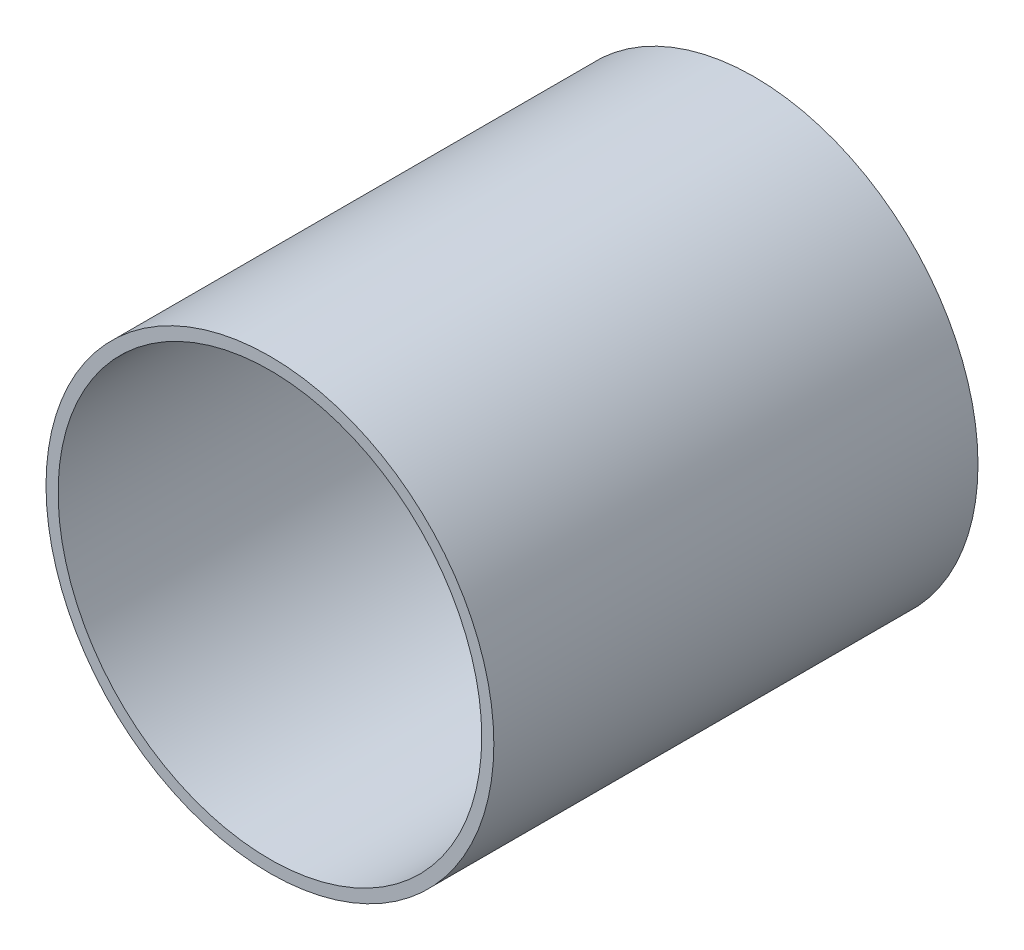
ISO-10303-21;
HEADER;
FILE_DESCRIPTION(('STEP AP214'),'2;1');
FILE_NAME('part.step','',(''),(''),'','','');
FILE_SCHEMA(('AUTOMOTIVE_DESIGN { 1 0 10303 214 1 1 1 1 }'));
ENDSEC;
DATA;
#1=APPLICATION_CONTEXT('core data for automotive mechanical design processes');
#2=APPLICATION_PROTOCOL_DEFINITION('international standard','automotive_design',2000,#1);
#3=PRODUCT_CONTEXT('',#1,'mechanical');
#4=PRODUCT('Part','Part','',(#3));
#5=PRODUCT_RELATED_PRODUCT_CATEGORY('part','',(#4));
#6=PRODUCT_DEFINITION_FORMATION('','',#4);
#7=PRODUCT_DEFINITION_CONTEXT('part definition',#1,'design');
#8=PRODUCT_DEFINITION('design','',#6,#7);
#9=PRODUCT_DEFINITION_SHAPE('','',#8);
#10=(LENGTH_UNIT() NAMED_UNIT(*) SI_UNIT(.MILLI.,.METRE.));
#11=(NAMED_UNIT(*) PLANE_ANGLE_UNIT() SI_UNIT($,.RADIAN.));
#12=(NAMED_UNIT(*) SI_UNIT($,.STERADIAN.) SOLID_ANGLE_UNIT());
#13=UNCERTAINTY_MEASURE_WITH_UNIT(LENGTH_MEASURE(1.E-05),#10,'distance_accuracy_value','');
#14=(GEOMETRIC_REPRESENTATION_CONTEXT(3) GLOBAL_UNCERTAINTY_ASSIGNED_CONTEXT((#13)) GLOBAL_UNIT_ASSIGNED_CONTEXT((#10,
#11,#12)) REPRESENTATION_CONTEXT('',''));
#15=CARTESIAN_POINT('',(0.,0.,0.));
#16=DIRECTION('',(0.,0.,1.));
#17=DIRECTION('',(1.,0.,0.));
#18=AXIS2_PLACEMENT_3D('',#15,#16,#17);
#19=CARTESIAN_POINT('',(0.,0.,16.));
#20=DIRECTION('',(0.,0.,1.));
#21=DIRECTION('',(1.,0.,0.));
#22=AXIS2_PLACEMENT_3D('',#19,#20,#21);
#23=PLANE('',#22);
#24=CARTESIAN_POINT('',(0.,0.,16.));
#25=DIRECTION('',(0.,0.,1.));
#26=DIRECTION('',(1.,0.,0.));
#27=AXIS2_PLACEMENT_3D('',#24,#25,#26);
#28=CIRCLE('',#27,7.4);
#29=CARTESIAN_POINT('',(7.4,0.,16.));
#30=VERTEX_POINT('',#29);
#31=EDGE_CURVE('E11',#30,#30,#28,.T.);
#32=ORIENTED_EDGE('',*,*,#31,.T.);
#33=EDGE_LOOP('',(#32));
#34=FACE_BOUND('',#33,.T.);
#35=CARTESIAN_POINT('',(0.,0.,16.));
#36=DIRECTION('',(0.,0.,1.));
#37=DIRECTION('',(1.,0.,0.));
#38=AXIS2_PLACEMENT_3D('',#35,#36,#37);
#39=CIRCLE('',#38,7.);
#40=CARTESIAN_POINT('',(7.,0.,16.));
#41=VERTEX_POINT('',#40);
#42=EDGE_CURVE('E62',#41,#41,#39,.T.);
#43=ORIENTED_EDGE('',*,*,#42,.F.);
#44=EDGE_LOOP('',(#43));
#45=FACE_BOUND('',#44,.T.);
#46=ADVANCED_FACE('F49',(#34,#45),#23,.T.);
#47=CARTESIAN_POINT('',(0.,0.,0.));
#48=DIRECTION('',(0.,0.,1.));
#49=DIRECTION('',(1.,0.,0.));
#50=AXIS2_PLACEMENT_3D('',#47,#48,#49);
#51=PLANE('',#50);
#52=CARTESIAN_POINT('',(0.,0.,0.));
#53=DIRECTION('',(0.,0.,1.));
#54=DIRECTION('',(1.,0.,0.));
#55=AXIS2_PLACEMENT_3D('',#52,#53,#54);
#56=CIRCLE('',#55,7.4);
#57=CARTESIAN_POINT('',(7.4,0.,0.));
#58=VERTEX_POINT('',#57);
#59=EDGE_CURVE('E53',#58,#58,#56,.T.);
#60=ORIENTED_EDGE('',*,*,#59,.F.);
#61=EDGE_LOOP('',(#60));
#62=FACE_BOUND('',#61,.T.);
#63=CARTESIAN_POINT('',(0.,0.,0.));
#64=DIRECTION('',(0.,0.,1.));
#65=DIRECTION('',(1.,0.,0.));
#66=AXIS2_PLACEMENT_3D('',#63,#64,#65);
#67=CIRCLE('',#66,7.);
#68=CARTESIAN_POINT('',(7.,0.,0.));
#69=VERTEX_POINT('',#68);
#70=EDGE_CURVE('E64',#69,#69,#67,.T.);
#71=ORIENTED_EDGE('',*,*,#70,.T.);
#72=EDGE_LOOP('',(#71));
#73=FACE_BOUND('',#72,.T.);
#74=ADVANCED_FACE('F76',(#62,#73),#51,.F.);
#75=CARTESIAN_POINT('',(0.,0.,16.));
#76=DIRECTION('',(0.,0.,-1.));
#77=DIRECTION('',(-1.,0.,0.));
#78=AXIS2_PLACEMENT_3D('',#75,#76,#77);
#79=CYLINDRICAL_SURFACE('',#78,7.4);
#80=ORIENTED_EDGE('',*,*,#31,.F.);
#81=EDGE_LOOP('',(#80));
#82=FACE_BOUND('',#81,.T.);
#83=ORIENTED_EDGE('',*,*,#59,.T.);
#84=EDGE_LOOP('',(#83));
#85=FACE_BOUND('',#84,.T.);
#86=ADVANCED_FACE('F51',(#82,#85),#79,.T.);
#87=CARTESIAN_POINT('',(0.,0.,16.));
#88=DIRECTION('',(0.,0.,-1.));
#89=DIRECTION('',(-1.,0.,0.));
#90=AXIS2_PLACEMENT_3D('',#87,#88,#89);
#91=CYLINDRICAL_SURFACE('',#90,7.);
#92=ORIENTED_EDGE('',*,*,#42,.T.);
#93=EDGE_LOOP('',(#92));
#94=FACE_BOUND('',#93,.T.);
#95=ORIENTED_EDGE('',*,*,#70,.F.);
#96=EDGE_LOOP('',(#95));
#97=FACE_BOUND('',#96,.T.);
#98=ADVANCED_FACE('F72',(#94,#97),#91,.F.);
#99=CLOSED_SHELL('',(#46,#74,#86,#98));
#100=MANIFOLD_SOLID_BREP('B2',#99);
#101=ADVANCED_BREP_SHAPE_REPRESENTATION('',(#18,#100),#14);
#102=SHAPE_DEFINITION_REPRESENTATION(#9,#101);
ENDSEC;
END-ISO-10303-21;
